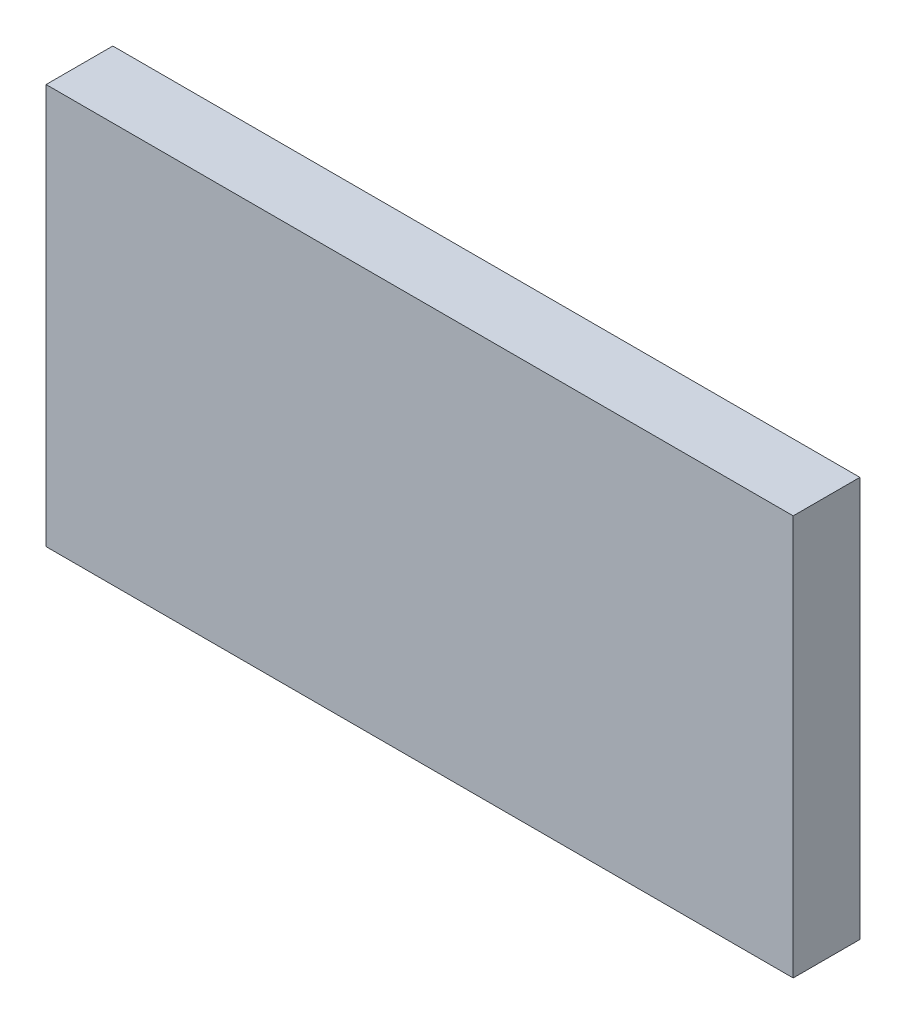
ISO-10303-21;
HEADER;
FILE_DESCRIPTION(('STEP AP214'),'2;1');
FILE_NAME('part.step','',(''),(''),'','','');
FILE_SCHEMA(('AUTOMOTIVE_DESIGN { 1 0 10303 214 1 1 1 1 }'));
ENDSEC;
DATA;
#1=APPLICATION_CONTEXT('core data for automotive mechanical design processes');
#2=APPLICATION_PROTOCOL_DEFINITION('international standard','automotive_design',2000,#1);
#3=PRODUCT_CONTEXT('',#1,'mechanical');
#4=PRODUCT('Part','Part','',(#3));
#5=PRODUCT_RELATED_PRODUCT_CATEGORY('part','',(#4));
#6=PRODUCT_DEFINITION_FORMATION('','',#4);
#7=PRODUCT_DEFINITION_CONTEXT('part definition',#1,'design');
#8=PRODUCT_DEFINITION('design','',#6,#7);
#9=PRODUCT_DEFINITION_SHAPE('','',#8);
#10=(LENGTH_UNIT() NAMED_UNIT(*) SI_UNIT(.MILLI.,.METRE.));
#11=(NAMED_UNIT(*) PLANE_ANGLE_UNIT() SI_UNIT($,.RADIAN.));
#12=(NAMED_UNIT(*) SI_UNIT($,.STERADIAN.) SOLID_ANGLE_UNIT());
#13=UNCERTAINTY_MEASURE_WITH_UNIT(LENGTH_MEASURE(1.E-05),#10,'distance_accuracy_value','');
#14=(GEOMETRIC_REPRESENTATION_CONTEXT(3) GLOBAL_UNCERTAINTY_ASSIGNED_CONTEXT((#13)) GLOBAL_UNIT_ASSIGNED_CONTEXT((#10,
#11,#12)) REPRESENTATION_CONTEXT('',''));
#15=CARTESIAN_POINT('',(0.,0.,0.));
#16=DIRECTION('',(0.,0.,1.));
#17=DIRECTION('',(1.,0.,0.));
#18=AXIS2_PLACEMENT_3D('',#15,#16,#17);
#19=CARTESIAN_POINT('',(-1.21972271238837,-0.755187491496895,0.0826433070866142));
#20=DIRECTION('',(0.,0.,1.));
#21=DIRECTION('',(0.,-1.,0.));
#22=AXIS2_PLACEMENT_3D('',#19,#20,#21);
#23=PLANE('',#22);
#24=DIRECTION('',(0.,1.,0.));
#25=VECTOR('',#24,1.);
#26=CARTESIAN_POINT('',(-1.29380145254586,-0.755187491496895,0.0826433070866142));
#27=LINE('',#26,#25);
#28=CARTESIAN_POINT('',(-1.29380145254586,-0.753297727717367,0.0826433070866142));
#29=VERTEX_POINT('',#28);
#30=CARTESIAN_POINT('',(-1.29380145254586,-0.715502452126816,0.0826433070866142));
#31=VERTEX_POINT('',#30);
#32=EDGE_CURVE('E71',#29,#31,#27,.T.);
#33=ORIENTED_EDGE('',*,*,#32,.T.);
#34=DIRECTION('',(1.,0.,0.));
#35=VECTOR('',#34,1.);
#36=CARTESIAN_POINT('',(-1.21972271238837,-0.715502452126816,0.0826433070866142));
#37=LINE('',#36,#35);
#38=CARTESIAN_POINT('',(-1.22325027144349,-0.715502452126816,0.0826433070866142));
#39=VERTEX_POINT('',#38);
#40=EDGE_CURVE('E54',#39,#31,#37,.F.);
#41=ORIENTED_EDGE('',*,*,#40,.F.);
#42=DIRECTION('',(0.,1.,0.));
#43=VECTOR('',#42,1.);
#44=CARTESIAN_POINT('',(-1.22325027144349,-0.755187491496895,0.0826433070866142));
#45=LINE('',#44,#43);
#46=CARTESIAN_POINT('',(-1.22325027144349,-0.753297727717367,0.0826433070866142));
#47=VERTEX_POINT('',#46);
#48=EDGE_CURVE('E20',#47,#39,#45,.T.);
#49=ORIENTED_EDGE('',*,*,#48,.F.);
#50=DIRECTION('',(1.,0.,0.));
#51=VECTOR('',#50,1.);
#52=CARTESIAN_POINT('',(-1.29732901160097,-0.753297727717367,0.0826433070866142));
#53=LINE('',#52,#51);
#54=EDGE_CURVE('E81',#29,#47,#53,.T.);
#55=ORIENTED_EDGE('',*,*,#54,.F.);
#56=EDGE_LOOP('',(#33,#41,#49,#55));
#57=FACE_BOUND('',#56,.T.);
#58=ADVANCED_FACE('F17',(#57),#23,.F.);
#59=CARTESIAN_POINT('',(-1.22325027144349,-0.755187491496895,0.0823283464566929));
#60=DIRECTION('',(-1.,0.,0.));
#61=DIRECTION('',(0.,0.,1.));
#62=AXIS2_PLACEMENT_3D('',#59,#60,#61);
#63=PLANE('',#62);
#64=DIRECTION('',(0.,0.,1.));
#65=VECTOR('',#64,1.);
#66=CARTESIAN_POINT('',(-1.22325027144349,-0.753297727717367,0.0823283464566929));
#67=LINE('',#66,#65);
#68=CARTESIAN_POINT('',(-1.22325027144349,-0.753297727717367,0.0889425196850394));
#69=VERTEX_POINT('',#68);
#70=EDGE_CURVE('E64',#47,#69,#67,.T.);
#71=ORIENTED_EDGE('',*,*,#70,.F.);
#72=ORIENTED_EDGE('',*,*,#48,.T.);
#73=DIRECTION('',(0.,0.,-1.));
#74=VECTOR('',#73,1.);
#75=CARTESIAN_POINT('',(-1.22325027144349,-0.715502452126816,0.0823283464566929));
#76=LINE('',#75,#74);
#77=CARTESIAN_POINT('',(-1.22325027144349,-0.715502452126816,0.0889425196850394));
#78=VERTEX_POINT('',#77);
#79=EDGE_CURVE('E62',#78,#39,#76,.T.);
#80=ORIENTED_EDGE('',*,*,#79,.F.);
#81=DIRECTION('',(0.,1.,0.));
#82=VECTOR('',#81,1.);
#83=CARTESIAN_POINT('',(-1.22325027144349,-0.755187491496895,0.0889425196850394));
#84=LINE('',#83,#82);
#85=EDGE_CURVE('E83',#69,#78,#84,.T.);
#86=ORIENTED_EDGE('',*,*,#85,.F.);
#87=EDGE_LOOP('',(#71,#72,#80,#86));
#88=FACE_BOUND('',#87,.T.);
#89=ADVANCED_FACE('F60',(#88),#63,.F.);
#90=CARTESIAN_POINT('',(-1.21972271238837,-0.715502452126816,0.0823283464566929));
#91=DIRECTION('',(0.,-1.,0.));
#92=DIRECTION('',(0.,0.,-1.));
#93=AXIS2_PLACEMENT_3D('',#90,#91,#92);
#94=PLANE('',#93);
#95=DIRECTION('',(0.,0.,1.));
#96=VECTOR('',#95,1.);
#97=CARTESIAN_POINT('',(-1.29380145254586,-0.715502452126816,0.0823283464566929));
#98=LINE('',#97,#96);
#99=CARTESIAN_POINT('',(-1.29380145254586,-0.715502452126816,0.0889425196850394));
#100=VERTEX_POINT('',#99);
#101=EDGE_CURVE('E73',#31,#100,#98,.T.);
#102=ORIENTED_EDGE('',*,*,#101,.T.);
#103=DIRECTION('',(1.,0.,0.));
#104=VECTOR('',#103,1.);
#105=CARTESIAN_POINT('',(-1.21972271238837,-0.715502452126816,0.0889425196850394));
#106=LINE('',#105,#104);
#107=EDGE_CURVE('E69',#78,#100,#106,.F.);
#108=ORIENTED_EDGE('',*,*,#107,.F.);
#109=ORIENTED_EDGE('',*,*,#79,.T.);
#110=ORIENTED_EDGE('',*,*,#40,.T.);
#111=EDGE_LOOP('',(#102,#108,#109,#110));
#112=FACE_BOUND('',#111,.T.);
#113=ADVANCED_FACE('F68',(#112),#94,.F.);
#114=CARTESIAN_POINT('',(-1.29380145254586,-0.755187491496895,0.0823283464566929));
#115=DIRECTION('',(-1.,0.,0.));
#116=DIRECTION('',(0.,0.,1.));
#117=AXIS2_PLACEMENT_3D('',#114,#115,#116);
#118=PLANE('',#117);
#119=ORIENTED_EDGE('',*,*,#32,.F.);
#120=DIRECTION('',(0.,0.,1.));
#121=VECTOR('',#120,1.);
#122=CARTESIAN_POINT('',(-1.29380145254586,-0.753297727717367,0.0823283464566929));
#123=LINE('',#122,#121);
#124=CARTESIAN_POINT('',(-1.29380145254586,-0.753297727717367,0.0889425196850394));
#125=VERTEX_POINT('',#124);
#126=EDGE_CURVE('E78',#125,#29,#123,.F.);
#127=ORIENTED_EDGE('',*,*,#126,.F.);
#128=DIRECTION('',(0.,1.,0.));
#129=VECTOR('',#128,1.);
#130=CARTESIAN_POINT('',(-1.29380145254586,-0.755187491496895,0.0889425196850394));
#131=LINE('',#130,#129);
#132=EDGE_CURVE('E26',#100,#125,#131,.F.);
#133=ORIENTED_EDGE('',*,*,#132,.F.);
#134=ORIENTED_EDGE('',*,*,#101,.F.);
#135=EDGE_LOOP('',(#119,#127,#133,#134));
#136=FACE_BOUND('',#135,.T.);
#137=ADVANCED_FACE('F88',(#136),#118,.T.);
#138=CARTESIAN_POINT('',(-1.29732901160097,-0.753297727717367,0.0823283464566929));
#139=DIRECTION('',(0.,1.,0.));
#140=DIRECTION('',(0.,0.,1.));
#141=AXIS2_PLACEMENT_3D('',#138,#139,#140);
#142=PLANE('',#141);
#143=ORIENTED_EDGE('',*,*,#126,.T.);
#144=ORIENTED_EDGE('',*,*,#54,.T.);
#145=ORIENTED_EDGE('',*,*,#70,.T.);
#146=DIRECTION('',(1.,0.,0.));
#147=VECTOR('',#146,1.);
#148=CARTESIAN_POINT('',(-1.21972271238837,-0.753297727717367,0.0889425196850394));
#149=LINE('',#148,#147);
#150=EDGE_CURVE('E11',#125,#69,#149,.T.);
#151=ORIENTED_EDGE('',*,*,#150,.F.);
#152=EDGE_LOOP('',(#143,#144,#145,#151));
#153=FACE_BOUND('',#152,.T.);
#154=ADVANCED_FACE('F91',(#153),#142,.F.);
#155=CARTESIAN_POINT('',(-1.21972271238837,-0.755187491496895,0.0889425196850394));
#156=DIRECTION('',(0.,0.,-1.));
#157=DIRECTION('',(0.,1.,0.));
#158=AXIS2_PLACEMENT_3D('',#155,#156,#157);
#159=PLANE('',#158);
#160=ORIENTED_EDGE('',*,*,#132,.T.);
#161=ORIENTED_EDGE('',*,*,#150,.T.);
#162=ORIENTED_EDGE('',*,*,#85,.T.);
#163=ORIENTED_EDGE('',*,*,#107,.T.);
#164=EDGE_LOOP('',(#160,#161,#162,#163));
#165=FACE_BOUND('',#164,.T.);
#166=ADVANCED_FACE('F86',(#165),#159,.F.);
#167=CLOSED_SHELL('',(#58,#89,#113,#137,#154,#166));
#168=MANIFOLD_SOLID_BREP('B1',#167);
#169=ADVANCED_BREP_SHAPE_REPRESENTATION('',(#18,#168),#14);
#170=SHAPE_DEFINITION_REPRESENTATION(#9,#169);
ENDSEC;
END-ISO-10303-21;
